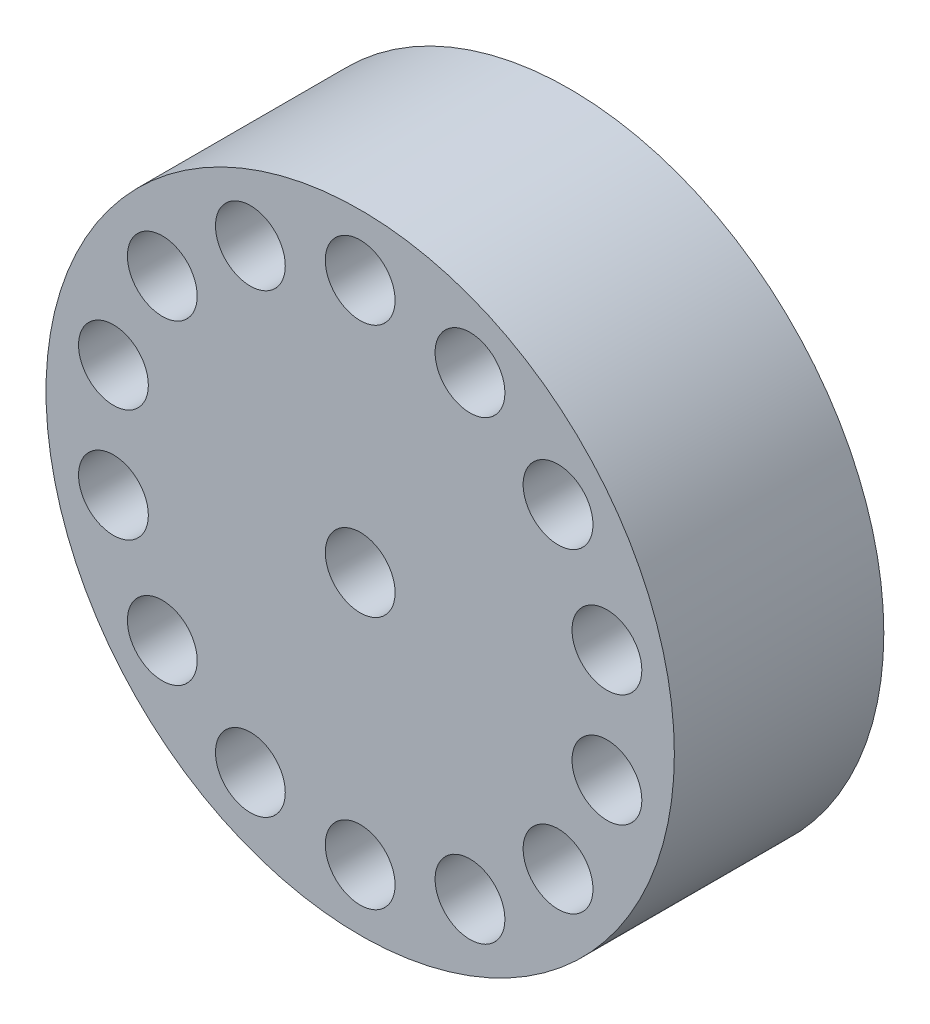
ISO-10303-21;
HEADER;
FILE_DESCRIPTION(('STEP AP214'),'2;1');
FILE_NAME('part.step','',(''),(''),'','','');
FILE_SCHEMA(('AUTOMOTIVE_DESIGN { 1 0 10303 214 1 1 1 1 }'));
ENDSEC;
DATA;
#1=APPLICATION_CONTEXT('core data for automotive mechanical design processes');
#2=APPLICATION_PROTOCOL_DEFINITION('international standard','automotive_design',2000,#1);
#3=PRODUCT_CONTEXT('',#1,'mechanical');
#4=PRODUCT('Part','Part','',(#3));
#5=PRODUCT_RELATED_PRODUCT_CATEGORY('part','',(#4));
#6=PRODUCT_DEFINITION_FORMATION('','',#4);
#7=PRODUCT_DEFINITION_CONTEXT('part definition',#1,'design');
#8=PRODUCT_DEFINITION('design','',#6,#7);
#9=PRODUCT_DEFINITION_SHAPE('','',#8);
#10=(LENGTH_UNIT() NAMED_UNIT(*) SI_UNIT(.MILLI.,.METRE.));
#11=(NAMED_UNIT(*) PLANE_ANGLE_UNIT() SI_UNIT($,.RADIAN.));
#12=(NAMED_UNIT(*) SI_UNIT($,.STERADIAN.) SOLID_ANGLE_UNIT());
#13=UNCERTAINTY_MEASURE_WITH_UNIT(LENGTH_MEASURE(1.E-05),#10,'distance_accuracy_value','');
#14=(GEOMETRIC_REPRESENTATION_CONTEXT(3) GLOBAL_UNCERTAINTY_ASSIGNED_CONTEXT((#13)) GLOBAL_UNIT_ASSIGNED_CONTEXT((#10,
#11,#12)) REPRESENTATION_CONTEXT('',''));
#15=CARTESIAN_POINT('',(0.,0.,0.));
#16=DIRECTION('',(0.,0.,1.));
#17=DIRECTION('',(1.,0.,0.));
#18=AXIS2_PLACEMENT_3D('',#15,#16,#17);
#19=CARTESIAN_POINT('',(0.,0.,3.));
#20=DIRECTION('',(0.,0.,1.));
#21=DIRECTION('',(1.,0.,0.));
#22=AXIS2_PLACEMENT_3D('',#19,#20,#21);
#23=PLANE('',#22);
#24=CARTESIAN_POINT('',(1.57282855430115,3.26601214614627,3.));
#25=DIRECTION('',(0.,0.,1.));
#26=DIRECTION('',(1.,0.,0.));
#27=AXIS2_PLACEMENT_3D('',#24,#25,#26);
#28=CIRCLE('',#27,0.5);
#29=CARTESIAN_POINT('',(2.07282855430115,3.26601214614627,3.));
#30=VERTEX_POINT('',#29);
#31=EDGE_CURVE('E99',#30,#30,#28,.T.);
#32=ORIENTED_EDGE('',*,*,#31,.F.);
#33=EDGE_LOOP('',(#32));
#34=FACE_BOUND('',#33,.T.);
#35=CARTESIAN_POINT('',(2.83413912394667,2.26015053173803,3.));
#36=DIRECTION('',(0.,0.,1.));
#37=DIRECTION('',(1.,0.,0.));
#38=AXIS2_PLACEMENT_3D('',#35,#36,#37);
#39=CIRCLE('',#38,0.500000000000028);
#40=CARTESIAN_POINT('',(3.33413912394669,2.26015053173803,3.));
#41=VERTEX_POINT('',#40);
#42=EDGE_CURVE('E93',#41,#41,#39,.T.);
#43=ORIENTED_EDGE('',*,*,#42,.F.);
#44=EDGE_LOOP('',(#43));
#45=FACE_BOUND('',#44,.T.);
#46=CARTESIAN_POINT('',(3.53411368165923,0.80663838559179,3.));
#47=DIRECTION('',(0.,0.,1.));
#48=DIRECTION('',(1.,0.,0.));
#49=AXIS2_PLACEMENT_3D('',#46,#47,#48);
#50=CIRCLE('',#49,0.500000000000081);
#51=CARTESIAN_POINT('',(4.03411368165931,0.80663838559179,3.));
#52=VERTEX_POINT('',#51);
#53=EDGE_CURVE('E87',#52,#52,#50,.T.);
#54=ORIENTED_EDGE('',*,*,#53,.F.);
#55=EDGE_LOOP('',(#54));
#56=FACE_BOUND('',#55,.T.);
#57=CARTESIAN_POINT('',(3.5341136816593,-0.80663838559149,3.));
#58=DIRECTION('',(0.,0.,1.));
#59=DIRECTION('',(1.,0.,0.));
#60=AXIS2_PLACEMENT_3D('',#57,#58,#59);
#61=CIRCLE('',#60,0.500000000000149);
#62=CARTESIAN_POINT('',(4.03411368165945,-0.80663838559149,3.));
#63=VERTEX_POINT('',#62);
#64=EDGE_CURVE('E81',#63,#63,#61,.T.);
#65=ORIENTED_EDGE('',*,*,#64,.F.);
#66=EDGE_LOOP('',(#65));
#67=FACE_BOUND('',#66,.T.);
#68=CARTESIAN_POINT('',(2.83413912394686,-2.26015053173779,3.));
#69=DIRECTION('',(0.,0.,1.));
#70=DIRECTION('',(1.,0.,0.));
#71=AXIS2_PLACEMENT_3D('',#68,#69,#70);
#72=CIRCLE('',#71,0.50000000000022);
#73=CARTESIAN_POINT('',(3.33413912394708,-2.26015053173779,3.));
#74=VERTEX_POINT('',#73);
#75=EDGE_CURVE('E75',#74,#74,#72,.T.);
#76=ORIENTED_EDGE('',*,*,#75,.F.);
#77=EDGE_LOOP('',(#76));
#78=FACE_BOUND('',#77,.T.);
#79=CARTESIAN_POINT('',(1.57282855430144,-3.2660121461462,3.));
#80=DIRECTION('',(0.,0.,1.));
#81=DIRECTION('',(1.,0.,0.));
#82=AXIS2_PLACEMENT_3D('',#79,#80,#81);
#83=CIRCLE('',#82,0.500000000000281);
#84=CARTESIAN_POINT('',(2.07282855430172,-3.2660121461462,3.));
#85=VERTEX_POINT('',#84);
#86=EDGE_CURVE('E69',#85,#85,#83,.T.);
#87=ORIENTED_EDGE('',*,*,#86,.F.);
#88=EDGE_LOOP('',(#87));
#89=FACE_BOUND('',#88,.T.);
#90=CARTESIAN_POINT('',(3.07754286661571E-13,-3.625,3.));
#91=DIRECTION('',(0.,0.,1.));
#92=DIRECTION('',(1.,0.,0.));
#93=AXIS2_PLACEMENT_3D('',#90,#91,#92);
#94=CIRCLE('',#93,0.500000000000319);
#95=CARTESIAN_POINT('',(0.500000000000626,-3.625,3.));
#96=VERTEX_POINT('',#95);
#97=EDGE_CURVE('E63',#96,#96,#94,.T.);
#98=ORIENTED_EDGE('',*,*,#97,.F.);
#99=EDGE_LOOP('',(#98));
#100=FACE_BOUND('',#99,.T.);
#101=CARTESIAN_POINT('',(-1.57282855430086,-3.26601214614634,3.));
#102=DIRECTION('',(0.,0.,1.));
#103=DIRECTION('',(1.,0.,0.));
#104=AXIS2_PLACEMENT_3D('',#101,#102,#103);
#105=CIRCLE('',#104,0.500000000000327);
#106=CARTESIAN_POINT('',(-1.07282855430053,-3.26601214614634,3.));
#107=VERTEX_POINT('',#106);
#108=EDGE_CURVE('E56',#107,#107,#105,.T.);
#109=ORIENTED_EDGE('',*,*,#108,.F.);
#110=EDGE_LOOP('',(#109));
#111=FACE_BOUND('',#110,.T.);
#112=CARTESIAN_POINT('',(-2.83413912394636,-2.26015053173803,3.));
#113=DIRECTION('',(0.,0.,1.));
#114=DIRECTION('',(1.,0.,0.));
#115=AXIS2_PLACEMENT_3D('',#112,#113,#114);
#116=CIRCLE('',#115,0.500000000000304);
#117=CARTESIAN_POINT('',(-2.33413912394605,-2.26015053173803,3.));
#118=VERTEX_POINT('',#117);
#119=EDGE_CURVE('E128',#118,#118,#116,.T.);
#120=ORIENTED_EDGE('',*,*,#119,.F.);
#121=EDGE_LOOP('',(#120));
#122=FACE_BOUND('',#121,.T.);
#123=CARTESIAN_POINT('',(-3.53411368165892,-0.80663838559179,3.));
#124=DIRECTION('',(0.,0.,1.));
#125=DIRECTION('',(1.,0.,0.));
#126=AXIS2_PLACEMENT_3D('',#123,#124,#125);
#127=CIRCLE('',#126,0.500000000000258);
#128=CARTESIAN_POINT('',(-3.03411368165867,-0.80663838559179,3.));
#129=VERTEX_POINT('',#128);
#130=EDGE_CURVE('E122',#129,#129,#127,.T.);
#131=ORIENTED_EDGE('',*,*,#130,.F.);
#132=EDGE_LOOP('',(#131));
#133=FACE_BOUND('',#132,.T.);
#134=CARTESIAN_POINT('',(-3.53411368165899,0.806638385591489,3.));
#135=DIRECTION('',(0.,0.,1.));
#136=DIRECTION('',(1.,0.,0.));
#137=AXIS2_PLACEMENT_3D('',#134,#135,#136);
#138=CIRCLE('',#137,0.500000000000195);
#139=CARTESIAN_POINT('',(-3.0341136816588,0.806638385591489,3.));
#140=VERTEX_POINT('',#139);
#141=EDGE_CURVE('E116',#140,#140,#138,.T.);
#142=ORIENTED_EDGE('',*,*,#141,.F.);
#143=EDGE_LOOP('',(#142));
#144=FACE_BOUND('',#143,.T.);
#145=CARTESIAN_POINT('',(-2.83413912394655,2.26015053173779,3.));
#146=DIRECTION('',(0.,0.,1.));
#147=DIRECTION('',(1.,0.,0.));
#148=AXIS2_PLACEMENT_3D('',#145,#146,#147);
#149=CIRCLE('',#148,0.500000000000134);
#150=CARTESIAN_POINT('',(-2.33413912394642,2.26015053173779,3.));
#151=VERTEX_POINT('',#150);
#152=EDGE_CURVE('E110',#151,#151,#149,.T.);
#153=ORIENTED_EDGE('',*,*,#152,.F.);
#154=EDGE_LOOP('',(#153));
#155=FACE_BOUND('',#154,.T.);
#156=CARTESIAN_POINT('',(-1.57282855430113,3.2660121461462,3.));
#157=DIRECTION('',(0.,0.,1.));
#158=DIRECTION('',(1.,0.,0.));
#159=AXIS2_PLACEMENT_3D('',#156,#157,#158);
#160=CIRCLE('',#159,0.50000000000008);
#161=CARTESIAN_POINT('',(-1.07282855430105,3.2660121461462,3.));
#162=VERTEX_POINT('',#161);
#163=EDGE_CURVE('E104',#162,#162,#160,.T.);
#164=ORIENTED_EDGE('',*,*,#163,.F.);
#165=EDGE_LOOP('',(#164));
#166=FACE_BOUND('',#165,.T.);
#167=CARTESIAN_POINT('',(0.,3.625,3.));
#168=DIRECTION('',(0.,0.,1.));
#169=DIRECTION('',(1.,0.,0.));
#170=AXIS2_PLACEMENT_3D('',#167,#168,#169);
#171=CIRCLE('',#170,0.5);
#172=CARTESIAN_POINT('',(0.5,3.625,3.));
#173=VERTEX_POINT('',#172);
#174=EDGE_CURVE('E50',#173,#173,#171,.T.);
#175=ORIENTED_EDGE('',*,*,#174,.F.);
#176=EDGE_LOOP('',(#175));
#177=FACE_BOUND('',#176,.T.);
#178=CARTESIAN_POINT('',(0.,0.,3.));
#179=DIRECTION('',(0.,0.,1.));
#180=DIRECTION('',(1.,0.,0.));
#181=AXIS2_PLACEMENT_3D('',#178,#179,#180);
#182=CIRCLE('',#181,4.5);
#183=CARTESIAN_POINT('',(4.5,0.,3.));
#184=VERTEX_POINT('',#183);
#185=EDGE_CURVE('E10',#184,#184,#182,.T.);
#186=ORIENTED_EDGE('',*,*,#185,.T.);
#187=EDGE_LOOP('',(#186));
#188=FACE_BOUND('',#187,.T.);
#189=CARTESIAN_POINT('',(0.,0.,3.));
#190=DIRECTION('',(0.,0.,1.));
#191=DIRECTION('',(1.,0.,0.));
#192=AXIS2_PLACEMENT_3D('',#189,#190,#191);
#193=CIRCLE('',#192,0.5);
#194=CARTESIAN_POINT('',(0.5,0.,3.));
#195=VERTEX_POINT('',#194);
#196=EDGE_CURVE('E42',#195,#195,#193,.T.);
#197=ORIENTED_EDGE('',*,*,#196,.F.);
#198=EDGE_LOOP('',(#197));
#199=FACE_BOUND('',#198,.T.);
#200=ADVANCED_FACE('F31',(#34,#45,#56,#67,#78,#89,#100,#111,#122,#133,#144,#155,#166,#177,#188,
#199),#23,.T.);
#201=CARTESIAN_POINT('',(0.,0.,0.));
#202=DIRECTION('',(0.,0.,1.));
#203=DIRECTION('',(1.,0.,0.));
#204=AXIS2_PLACEMENT_3D('',#201,#202,#203);
#205=PLANE('',#204);
#206=CARTESIAN_POINT('',(0.,0.,0.));
#207=DIRECTION('',(0.,0.,1.));
#208=DIRECTION('',(1.,0.,0.));
#209=AXIS2_PLACEMENT_3D('',#206,#207,#208);
#210=CIRCLE('',#209,4.5);
#211=CARTESIAN_POINT('',(4.5,0.,0.));
#212=VERTEX_POINT('',#211);
#213=EDGE_CURVE('E35',#212,#212,#210,.T.);
#214=ORIENTED_EDGE('',*,*,#213,.F.);
#215=EDGE_LOOP('',(#214));
#216=FACE_BOUND('',#215,.T.);
#217=CARTESIAN_POINT('',(0.,0.,0.));
#218=DIRECTION('',(0.,0.,1.));
#219=DIRECTION('',(1.,0.,0.));
#220=AXIS2_PLACEMENT_3D('',#217,#218,#219);
#221=CIRCLE('',#220,0.5);
#222=CARTESIAN_POINT('',(0.5,0.,0.));
#223=VERTEX_POINT('',#222);
#224=EDGE_CURVE('E44',#223,#223,#221,.T.);
#225=ORIENTED_EDGE('',*,*,#224,.T.);
#226=EDGE_LOOP('',(#225));
#227=FACE_BOUND('',#226,.T.);
#228=ADVANCED_FACE('F145',(#216,#227),#205,.F.);
#229=CARTESIAN_POINT('',(0.,0.,3.));
#230=DIRECTION('',(0.,0.,-1.));
#231=DIRECTION('',(-1.,0.,0.));
#232=AXIS2_PLACEMENT_3D('',#229,#230,#231);
#233=CYLINDRICAL_SURFACE('',#232,4.5);
#234=ORIENTED_EDGE('',*,*,#185,.F.);
#235=EDGE_LOOP('',(#234));
#236=FACE_BOUND('',#235,.T.);
#237=ORIENTED_EDGE('',*,*,#213,.T.);
#238=EDGE_LOOP('',(#237));
#239=FACE_BOUND('',#238,.T.);
#240=ADVANCED_FACE('F33',(#236,#239),#233,.T.);
#241=CARTESIAN_POINT('',(0.,0.,3.));
#242=DIRECTION('',(0.,0.,-1.));
#243=DIRECTION('',(-1.,0.,0.));
#244=AXIS2_PLACEMENT_3D('',#241,#242,#243);
#245=CYLINDRICAL_SURFACE('',#244,0.5);
#246=ORIENTED_EDGE('',*,*,#196,.T.);
#247=EDGE_LOOP('',(#246));
#248=FACE_BOUND('',#247,.T.);
#249=ORIENTED_EDGE('',*,*,#224,.F.);
#250=EDGE_LOOP('',(#249));
#251=FACE_BOUND('',#250,.T.);
#252=ADVANCED_FACE('F160',(#248,#251),#245,.F.);
#253=CARTESIAN_POINT('',(0.,3.625,2.));
#254=DIRECTION('',(0.,0.,1.));
#255=DIRECTION('',(1.,0.,0.));
#256=AXIS2_PLACEMENT_3D('',#253,#254,#255);
#257=CYLINDRICAL_SURFACE('',#256,0.5);
#258=CARTESIAN_POINT('',(0.,3.625,2.));
#259=DIRECTION('',(0.,0.,1.));
#260=DIRECTION('',(1.,0.,0.));
#261=AXIS2_PLACEMENT_3D('',#258,#259,#260);
#262=CIRCLE('',#261,0.5);
#263=CARTESIAN_POINT('',(0.5,3.625,2.));
#264=VERTEX_POINT('',#263);
#265=EDGE_CURVE('E47',#264,#264,#262,.T.);
#266=ORIENTED_EDGE('',*,*,#265,.F.);
#267=EDGE_LOOP('',(#266));
#268=FACE_BOUND('',#267,.T.);
#269=ORIENTED_EDGE('',*,*,#174,.T.);
#270=EDGE_LOOP('',(#269));
#271=FACE_BOUND('',#270,.T.);
#272=ADVANCED_FACE('F163',(#268,#271),#257,.F.);
#273=CARTESIAN_POINT('',(0.,3.625,2.));
#274=DIRECTION('',(0.,0.,1.));
#275=DIRECTION('',(1.,0.,0.));
#276=AXIS2_PLACEMENT_3D('',#273,#274,#275);
#277=PLANE('',#276);
#278=ORIENTED_EDGE('',*,*,#265,.T.);
#279=EDGE_LOOP('',(#278));
#280=FACE_BOUND('',#279,.T.);
#281=ADVANCED_FACE('F177',(#280),#277,.T.);
#282=CARTESIAN_POINT('',(-1.57282855430113,3.2660121461462,2.));
#283=DIRECTION('',(0.,0.,1.));
#284=DIRECTION('',(1.,0.,0.));
#285=AXIS2_PLACEMENT_3D('',#282,#283,#284);
#286=CYLINDRICAL_SURFACE('',#285,0.50000000000008);
#287=CARTESIAN_POINT('',(-1.57282855430113,3.2660121461462,2.));
#288=DIRECTION('',(0.,0.,1.));
#289=DIRECTION('',(1.,0.,0.));
#290=AXIS2_PLACEMENT_3D('',#287,#288,#289);
#291=CIRCLE('',#290,0.50000000000008);
#292=CARTESIAN_POINT('',(-1.07282855430105,3.2660121461462,2.));
#293=VERTEX_POINT('',#292);
#294=EDGE_CURVE('E107',#293,#293,#291,.T.);
#295=ORIENTED_EDGE('',*,*,#294,.F.);
#296=EDGE_LOOP('',(#295));
#297=FACE_BOUND('',#296,.T.);
#298=ORIENTED_EDGE('',*,*,#163,.T.);
#299=EDGE_LOOP('',(#298));
#300=FACE_BOUND('',#299,.T.);
#301=ADVANCED_FACE('F181',(#297,#300),#286,.F.);
#302=CARTESIAN_POINT('',(-1.57282855430113,3.2660121461462,2.));
#303=DIRECTION('',(0.,0.,1.));
#304=DIRECTION('',(1.,0.,0.));
#305=AXIS2_PLACEMENT_3D('',#302,#303,#304);
#306=PLANE('',#305);
#307=ORIENTED_EDGE('',*,*,#294,.T.);
#308=EDGE_LOOP('',(#307));
#309=FACE_BOUND('',#308,.T.);
#310=ADVANCED_FACE('F249',(#309),#306,.T.);
#311=CARTESIAN_POINT('',(-2.83413912394655,2.26015053173779,2.));
#312=DIRECTION('',(0.,0.,1.));
#313=DIRECTION('',(1.,0.,0.));
#314=AXIS2_PLACEMENT_3D('',#311,#312,#313);
#315=CYLINDRICAL_SURFACE('',#314,0.500000000000134);
#316=CARTESIAN_POINT('',(-2.83413912394655,2.26015053173779,2.));
#317=DIRECTION('',(0.,0.,1.));
#318=DIRECTION('',(1.,0.,0.));
#319=AXIS2_PLACEMENT_3D('',#316,#317,#318);
#320=CIRCLE('',#319,0.500000000000134);
#321=CARTESIAN_POINT('',(-2.33413912394642,2.26015053173779,2.));
#322=VERTEX_POINT('',#321);
#323=EDGE_CURVE('E113',#322,#322,#320,.T.);
#324=ORIENTED_EDGE('',*,*,#323,.F.);
#325=EDGE_LOOP('',(#324));
#326=FACE_BOUND('',#325,.T.);
#327=ORIENTED_EDGE('',*,*,#152,.T.);
#328=EDGE_LOOP('',(#327));
#329=FACE_BOUND('',#328,.T.);
#330=ADVANCED_FACE('F253',(#326,#329),#315,.F.);
#331=CARTESIAN_POINT('',(-2.83413912394655,2.26015053173779,2.));
#332=DIRECTION('',(0.,0.,1.));
#333=DIRECTION('',(1.,0.,0.));
#334=AXIS2_PLACEMENT_3D('',#331,#332,#333);
#335=PLANE('',#334);
#336=ORIENTED_EDGE('',*,*,#323,.T.);
#337=EDGE_LOOP('',(#336));
#338=FACE_BOUND('',#337,.T.);
#339=ADVANCED_FACE('F257',(#338),#335,.T.);
#340=CARTESIAN_POINT('',(-3.53411368165899,0.806638385591489,2.));
#341=DIRECTION('',(0.,0.,1.));
#342=DIRECTION('',(1.,0.,0.));
#343=AXIS2_PLACEMENT_3D('',#340,#341,#342);
#344=CYLINDRICAL_SURFACE('',#343,0.500000000000195);
#345=CARTESIAN_POINT('',(-3.53411368165899,0.806638385591489,2.));
#346=DIRECTION('',(0.,0.,1.));
#347=DIRECTION('',(1.,0.,0.));
#348=AXIS2_PLACEMENT_3D('',#345,#346,#347);
#349=CIRCLE('',#348,0.500000000000195);
#350=CARTESIAN_POINT('',(-3.0341136816588,0.806638385591489,2.));
#351=VERTEX_POINT('',#350);
#352=EDGE_CURVE('E119',#351,#351,#349,.T.);
#353=ORIENTED_EDGE('',*,*,#352,.F.);
#354=EDGE_LOOP('',(#353));
#355=FACE_BOUND('',#354,.T.);
#356=ORIENTED_EDGE('',*,*,#141,.T.);
#357=EDGE_LOOP('',(#356));
#358=FACE_BOUND('',#357,.T.);
#359=ADVANCED_FACE('F261',(#355,#358),#344,.F.);
#360=CARTESIAN_POINT('',(-3.53411368165899,0.806638385591489,2.));
#361=DIRECTION('',(0.,0.,1.));
#362=DIRECTION('',(1.,0.,0.));
#363=AXIS2_PLACEMENT_3D('',#360,#361,#362);
#364=PLANE('',#363);
#365=ORIENTED_EDGE('',*,*,#352,.T.);
#366=EDGE_LOOP('',(#365));
#367=FACE_BOUND('',#366,.T.);
#368=ADVANCED_FACE('F265',(#367),#364,.T.);
#369=CARTESIAN_POINT('',(-3.53411368165892,-0.80663838559179,2.));
#370=DIRECTION('',(0.,0.,1.));
#371=DIRECTION('',(1.,0.,0.));
#372=AXIS2_PLACEMENT_3D('',#369,#370,#371);
#373=CYLINDRICAL_SURFACE('',#372,0.500000000000258);
#374=CARTESIAN_POINT('',(-3.53411368165892,-0.80663838559179,2.));
#375=DIRECTION('',(0.,0.,1.));
#376=DIRECTION('',(1.,0.,0.));
#377=AXIS2_PLACEMENT_3D('',#374,#375,#376);
#378=CIRCLE('',#377,0.500000000000258);
#379=CARTESIAN_POINT('',(-3.03411368165867,-0.80663838559179,2.));
#380=VERTEX_POINT('',#379);
#381=EDGE_CURVE('E125',#380,#380,#378,.T.);
#382=ORIENTED_EDGE('',*,*,#381,.F.);
#383=EDGE_LOOP('',(#382));
#384=FACE_BOUND('',#383,.T.);
#385=ORIENTED_EDGE('',*,*,#130,.T.);
#386=EDGE_LOOP('',(#385));
#387=FACE_BOUND('',#386,.T.);
#388=ADVANCED_FACE('F269',(#384,#387),#373,.F.);
#389=CARTESIAN_POINT('',(-3.53411368165892,-0.80663838559179,2.));
#390=DIRECTION('',(0.,0.,1.));
#391=DIRECTION('',(1.,0.,0.));
#392=AXIS2_PLACEMENT_3D('',#389,#390,#391);
#393=PLANE('',#392);
#394=ORIENTED_EDGE('',*,*,#381,.T.);
#395=EDGE_LOOP('',(#394));
#396=FACE_BOUND('',#395,.T.);
#397=ADVANCED_FACE('F139',(#396),#393,.T.);
#398=CARTESIAN_POINT('',(-2.83413912394636,-2.26015053173803,2.));
#399=DIRECTION('',(0.,0.,1.));
#400=DIRECTION('',(1.,0.,0.));
#401=AXIS2_PLACEMENT_3D('',#398,#399,#400);
#402=CYLINDRICAL_SURFACE('',#401,0.500000000000304);
#403=CARTESIAN_POINT('',(-2.83413912394636,-2.26015053173803,2.));
#404=DIRECTION('',(0.,0.,1.));
#405=DIRECTION('',(1.,0.,0.));
#406=AXIS2_PLACEMENT_3D('',#403,#404,#405);
#407=CIRCLE('',#406,0.500000000000304);
#408=CARTESIAN_POINT('',(-2.33413912394605,-2.26015053173803,2.));
#409=VERTEX_POINT('',#408);
#410=EDGE_CURVE('E60',#409,#409,#407,.T.);
#411=ORIENTED_EDGE('',*,*,#410,.F.);
#412=EDGE_LOOP('',(#411));
#413=FACE_BOUND('',#412,.T.);
#414=ORIENTED_EDGE('',*,*,#119,.T.);
#415=EDGE_LOOP('',(#414));
#416=FACE_BOUND('',#415,.T.);
#417=ADVANCED_FACE('F136',(#413,#416),#402,.F.);
#418=CARTESIAN_POINT('',(-2.83413912394636,-2.26015053173803,2.));
#419=DIRECTION('',(0.,0.,1.));
#420=DIRECTION('',(1.,0.,0.));
#421=AXIS2_PLACEMENT_3D('',#418,#419,#420);
#422=PLANE('',#421);
#423=ORIENTED_EDGE('',*,*,#410,.T.);
#424=EDGE_LOOP('',(#423));
#425=FACE_BOUND('',#424,.T.);
#426=ADVANCED_FACE('F134',(#425),#422,.T.);
#427=CARTESIAN_POINT('',(-1.57282855430086,-3.26601214614634,2.));
#428=DIRECTION('',(0.,0.,1.));
#429=DIRECTION('',(1.,0.,0.));
#430=AXIS2_PLACEMENT_3D('',#427,#428,#429);
#431=CYLINDRICAL_SURFACE('',#430,0.500000000000327);
#432=CARTESIAN_POINT('',(-1.57282855430086,-3.26601214614634,2.));
#433=DIRECTION('',(0.,0.,1.));
#434=DIRECTION('',(1.,0.,0.));
#435=AXIS2_PLACEMENT_3D('',#432,#433,#434);
#436=CIRCLE('',#435,0.500000000000327);
#437=CARTESIAN_POINT('',(-1.07282855430053,-3.26601214614634,2.));
#438=VERTEX_POINT('',#437);
#439=EDGE_CURVE('E59',#438,#438,#436,.T.);
#440=ORIENTED_EDGE('',*,*,#439,.F.);
#441=EDGE_LOOP('',(#440));
#442=FACE_BOUND('',#441,.T.);
#443=ORIENTED_EDGE('',*,*,#108,.T.);
#444=EDGE_LOOP('',(#443));
#445=FACE_BOUND('',#444,.T.);
#446=ADVANCED_FACE('F183',(#442,#445),#431,.F.);
#447=CARTESIAN_POINT('',(-1.57282855430086,-3.26601214614634,2.));
#448=DIRECTION('',(0.,0.,1.));
#449=DIRECTION('',(1.,0.,0.));
#450=AXIS2_PLACEMENT_3D('',#447,#448,#449);
#451=PLANE('',#450);
#452=ORIENTED_EDGE('',*,*,#439,.T.);
#453=EDGE_LOOP('',(#452));
#454=FACE_BOUND('',#453,.T.);
#455=ADVANCED_FACE('F186',(#454),#451,.T.);
#456=CARTESIAN_POINT('',(3.07754286661571E-13,-3.625,2.));
#457=DIRECTION('',(0.,0.,1.));
#458=DIRECTION('',(1.,0.,0.));
#459=AXIS2_PLACEMENT_3D('',#456,#457,#458);
#460=CYLINDRICAL_SURFACE('',#459,0.500000000000319);
#461=CARTESIAN_POINT('',(3.07754286661571E-13,-3.625,2.));
#462=DIRECTION('',(0.,0.,1.));
#463=DIRECTION('',(1.,0.,0.));
#464=AXIS2_PLACEMENT_3D('',#461,#462,#463);
#465=CIRCLE('',#464,0.500000000000319);
#466=CARTESIAN_POINT('',(0.500000000000626,-3.625,2.));
#467=VERTEX_POINT('',#466);
#468=EDGE_CURVE('E66',#467,#467,#465,.T.);
#469=ORIENTED_EDGE('',*,*,#468,.F.);
#470=EDGE_LOOP('',(#469));
#471=FACE_BOUND('',#470,.T.);
#472=ORIENTED_EDGE('',*,*,#97,.T.);
#473=EDGE_LOOP('',(#472));
#474=FACE_BOUND('',#473,.T.);
#475=ADVANCED_FACE('F190',(#471,#474),#460,.F.);
#476=CARTESIAN_POINT('',(3.07754286661571E-13,-3.625,2.));
#477=DIRECTION('',(0.,0.,1.));
#478=DIRECTION('',(1.,0.,0.));
#479=AXIS2_PLACEMENT_3D('',#476,#477,#478);
#480=PLANE('',#479);
#481=ORIENTED_EDGE('',*,*,#468,.T.);
#482=EDGE_LOOP('',(#481));
#483=FACE_BOUND('',#482,.T.);
#484=ADVANCED_FACE('F194',(#483),#480,.T.);
#485=CARTESIAN_POINT('',(1.57282855430144,-3.2660121461462,2.));
#486=DIRECTION('',(0.,0.,1.));
#487=DIRECTION('',(1.,0.,0.));
#488=AXIS2_PLACEMENT_3D('',#485,#486,#487);
#489=CYLINDRICAL_SURFACE('',#488,0.500000000000281);
#490=CARTESIAN_POINT('',(1.57282855430144,-3.2660121461462,2.));
#491=DIRECTION('',(0.,0.,1.));
#492=DIRECTION('',(1.,0.,0.));
#493=AXIS2_PLACEMENT_3D('',#490,#491,#492);
#494=CIRCLE('',#493,0.500000000000281);
#495=CARTESIAN_POINT('',(2.07282855430172,-3.2660121461462,2.));
#496=VERTEX_POINT('',#495);
#497=EDGE_CURVE('E72',#496,#496,#494,.T.);
#498=ORIENTED_EDGE('',*,*,#497,.F.);
#499=EDGE_LOOP('',(#498));
#500=FACE_BOUND('',#499,.T.);
#501=ORIENTED_EDGE('',*,*,#86,.T.);
#502=EDGE_LOOP('',(#501));
#503=FACE_BOUND('',#502,.T.);
#504=ADVANCED_FACE('F198',(#500,#503),#489,.F.);
#505=CARTESIAN_POINT('',(1.57282855430144,-3.2660121461462,2.));
#506=DIRECTION('',(0.,0.,1.));
#507=DIRECTION('',(1.,0.,0.));
#508=AXIS2_PLACEMENT_3D('',#505,#506,#507);
#509=PLANE('',#508);
#510=ORIENTED_EDGE('',*,*,#497,.T.);
#511=EDGE_LOOP('',(#510));
#512=FACE_BOUND('',#511,.T.);
#513=ADVANCED_FACE('F202',(#512),#509,.T.);
#514=CARTESIAN_POINT('',(2.83413912394686,-2.26015053173779,2.));
#515=DIRECTION('',(0.,0.,1.));
#516=DIRECTION('',(1.,0.,0.));
#517=AXIS2_PLACEMENT_3D('',#514,#515,#516);
#518=CYLINDRICAL_SURFACE('',#517,0.50000000000022);
#519=CARTESIAN_POINT('',(2.83413912394686,-2.26015053173779,2.));
#520=DIRECTION('',(0.,0.,1.));
#521=DIRECTION('',(1.,0.,0.));
#522=AXIS2_PLACEMENT_3D('',#519,#520,#521);
#523=CIRCLE('',#522,0.50000000000022);
#524=CARTESIAN_POINT('',(3.33413912394708,-2.26015053173779,2.));
#525=VERTEX_POINT('',#524);
#526=EDGE_CURVE('E78',#525,#525,#523,.T.);
#527=ORIENTED_EDGE('',*,*,#526,.F.);
#528=EDGE_LOOP('',(#527));
#529=FACE_BOUND('',#528,.T.);
#530=ORIENTED_EDGE('',*,*,#75,.T.);
#531=EDGE_LOOP('',(#530));
#532=FACE_BOUND('',#531,.T.);
#533=ADVANCED_FACE('F206',(#529,#532),#518,.F.);
#534=CARTESIAN_POINT('',(2.83413912394686,-2.26015053173779,2.));
#535=DIRECTION('',(0.,0.,1.));
#536=DIRECTION('',(1.,0.,0.));
#537=AXIS2_PLACEMENT_3D('',#534,#535,#536);
#538=PLANE('',#537);
#539=ORIENTED_EDGE('',*,*,#526,.T.);
#540=EDGE_LOOP('',(#539));
#541=FACE_BOUND('',#540,.T.);
#542=ADVANCED_FACE('F210',(#541),#538,.T.);
#543=CARTESIAN_POINT('',(3.5341136816593,-0.80663838559149,2.));
#544=DIRECTION('',(0.,0.,1.));
#545=DIRECTION('',(1.,0.,0.));
#546=AXIS2_PLACEMENT_3D('',#543,#544,#545);
#547=CYLINDRICAL_SURFACE('',#546,0.500000000000149);
#548=CARTESIAN_POINT('',(3.5341136816593,-0.80663838559149,2.));
#549=DIRECTION('',(0.,0.,1.));
#550=DIRECTION('',(1.,0.,0.));
#551=AXIS2_PLACEMENT_3D('',#548,#549,#550);
#552=CIRCLE('',#551,0.500000000000149);
#553=CARTESIAN_POINT('',(4.03411368165945,-0.80663838559149,2.));
#554=VERTEX_POINT('',#553);
#555=EDGE_CURVE('E84',#554,#554,#552,.T.);
#556=ORIENTED_EDGE('',*,*,#555,.F.);
#557=EDGE_LOOP('',(#556));
#558=FACE_BOUND('',#557,.T.);
#559=ORIENTED_EDGE('',*,*,#64,.T.);
#560=EDGE_LOOP('',(#559));
#561=FACE_BOUND('',#560,.T.);
#562=ADVANCED_FACE('F214',(#558,#561),#547,.F.);
#563=CARTESIAN_POINT('',(3.5341136816593,-0.80663838559149,2.));
#564=DIRECTION('',(0.,0.,1.));
#565=DIRECTION('',(1.,0.,0.));
#566=AXIS2_PLACEMENT_3D('',#563,#564,#565);
#567=PLANE('',#566);
#568=ORIENTED_EDGE('',*,*,#555,.T.);
#569=EDGE_LOOP('',(#568));
#570=FACE_BOUND('',#569,.T.);
#571=ADVANCED_FACE('F218',(#570),#567,.T.);
#572=CARTESIAN_POINT('',(3.53411368165923,0.80663838559179,2.));
#573=DIRECTION('',(0.,0.,1.));
#574=DIRECTION('',(1.,0.,0.));
#575=AXIS2_PLACEMENT_3D('',#572,#573,#574);
#576=CYLINDRICAL_SURFACE('',#575,0.500000000000081);
#577=CARTESIAN_POINT('',(3.53411368165923,0.80663838559179,2.));
#578=DIRECTION('',(0.,0.,1.));
#579=DIRECTION('',(1.,0.,0.));
#580=AXIS2_PLACEMENT_3D('',#577,#578,#579);
#581=CIRCLE('',#580,0.500000000000081);
#582=CARTESIAN_POINT('',(4.03411368165931,0.80663838559179,2.));
#583=VERTEX_POINT('',#582);
#584=EDGE_CURVE('E90',#583,#583,#581,.T.);
#585=ORIENTED_EDGE('',*,*,#584,.F.);
#586=EDGE_LOOP('',(#585));
#587=FACE_BOUND('',#586,.T.);
#588=ORIENTED_EDGE('',*,*,#53,.T.);
#589=EDGE_LOOP('',(#588));
#590=FACE_BOUND('',#589,.T.);
#591=ADVANCED_FACE('F222',(#587,#590),#576,.F.);
#592=CARTESIAN_POINT('',(3.53411368165923,0.80663838559179,2.));
#593=DIRECTION('',(0.,0.,1.));
#594=DIRECTION('',(1.,0.,0.));
#595=AXIS2_PLACEMENT_3D('',#592,#593,#594);
#596=PLANE('',#595);
#597=ORIENTED_EDGE('',*,*,#584,.T.);
#598=EDGE_LOOP('',(#597));
#599=FACE_BOUND('',#598,.T.);
#600=ADVANCED_FACE('F226',(#599),#596,.T.);
#601=CARTESIAN_POINT('',(2.83413912394667,2.26015053173803,2.));
#602=DIRECTION('',(0.,0.,1.));
#603=DIRECTION('',(1.,0.,0.));
#604=AXIS2_PLACEMENT_3D('',#601,#602,#603);
#605=CYLINDRICAL_SURFACE('',#604,0.500000000000028);
#606=CARTESIAN_POINT('',(2.83413912394667,2.26015053173803,2.));
#607=DIRECTION('',(0.,0.,1.));
#608=DIRECTION('',(1.,0.,0.));
#609=AXIS2_PLACEMENT_3D('',#606,#607,#608);
#610=CIRCLE('',#609,0.500000000000028);
#611=CARTESIAN_POINT('',(3.33413912394669,2.26015053173803,2.));
#612=VERTEX_POINT('',#611);
#613=EDGE_CURVE('E96',#612,#612,#610,.T.);
#614=ORIENTED_EDGE('',*,*,#613,.F.);
#615=EDGE_LOOP('',(#614));
#616=FACE_BOUND('',#615,.T.);
#617=ORIENTED_EDGE('',*,*,#42,.T.);
#618=EDGE_LOOP('',(#617));
#619=FACE_BOUND('',#618,.T.);
#620=ADVANCED_FACE('F230',(#616,#619),#605,.F.);
#621=CARTESIAN_POINT('',(2.83413912394667,2.26015053173803,2.));
#622=DIRECTION('',(0.,0.,1.));
#623=DIRECTION('',(1.,0.,0.));
#624=AXIS2_PLACEMENT_3D('',#621,#622,#623);
#625=PLANE('',#624);
#626=ORIENTED_EDGE('',*,*,#613,.T.);
#627=EDGE_LOOP('',(#626));
#628=FACE_BOUND('',#627,.T.);
#629=ADVANCED_FACE('F234',(#628),#625,.T.);
#630=CARTESIAN_POINT('',(1.57282855430115,3.26601214614627,2.));
#631=DIRECTION('',(0.,0.,1.));
#632=DIRECTION('',(1.,0.,0.));
#633=AXIS2_PLACEMENT_3D('',#630,#631,#632);
#634=CYLINDRICAL_SURFACE('',#633,0.5);
#635=CARTESIAN_POINT('',(1.57282855430115,3.26601214614627,2.));
#636=DIRECTION('',(0.,0.,1.));
#637=DIRECTION('',(1.,0.,0.));
#638=AXIS2_PLACEMENT_3D('',#635,#636,#637);
#639=CIRCLE('',#638,0.5);
#640=CARTESIAN_POINT('',(2.07282855430115,3.26601214614627,2.));
#641=VERTEX_POINT('',#640);
#642=EDGE_CURVE('E53',#641,#641,#639,.T.);
#643=ORIENTED_EDGE('',*,*,#642,.F.);
#644=EDGE_LOOP('',(#643));
#645=FACE_BOUND('',#644,.T.);
#646=ORIENTED_EDGE('',*,*,#31,.T.);
#647=EDGE_LOOP('',(#646));
#648=FACE_BOUND('',#647,.T.);
#649=ADVANCED_FACE('F238',(#645,#648),#634,.F.);
#650=CARTESIAN_POINT('',(1.57282855430115,3.26601214614627,2.));
#651=DIRECTION('',(0.,0.,1.));
#652=DIRECTION('',(1.,0.,0.));
#653=AXIS2_PLACEMENT_3D('',#650,#651,#652);
#654=PLANE('',#653);
#655=ORIENTED_EDGE('',*,*,#642,.T.);
#656=EDGE_LOOP('',(#655));
#657=FACE_BOUND('',#656,.T.);
#658=ADVANCED_FACE('F242',(#657),#654,.T.);
#659=CLOSED_SHELL('',(#200,#228,#240,#252,#272,#281,#301,#310,#330,#339,#359,#368,#388,#397,
#417,#426,#446,#455,#475,#484,#504,#513,#533,#542,#562,#571,#591,#600,#620,#629,#649,#658));
#660=MANIFOLD_SOLID_BREP('B2',#659);
#661=ADVANCED_BREP_SHAPE_REPRESENTATION('',(#18,#660),#14);
#662=SHAPE_DEFINITION_REPRESENTATION(#9,#661);
ENDSEC;
END-ISO-10303-21;
